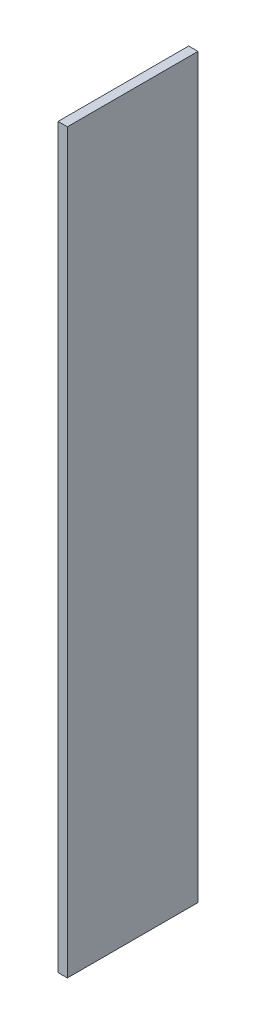
ISO-10303-21;
HEADER;
FILE_DESCRIPTION(('STEP AP214'),'2;1');
FILE_NAME('part.step','',(''),(''),'','','');
FILE_SCHEMA(('AUTOMOTIVE_DESIGN { 1 0 10303 214 1 1 1 1 }'));
ENDSEC;
DATA;
#1=APPLICATION_CONTEXT('core data for automotive mechanical design processes');
#2=APPLICATION_PROTOCOL_DEFINITION('international standard','automotive_design',2000,#1);
#3=PRODUCT_CONTEXT('',#1,'mechanical');
#4=PRODUCT('Part','Part','',(#3));
#5=PRODUCT_RELATED_PRODUCT_CATEGORY('part','',(#4));
#6=PRODUCT_DEFINITION_FORMATION('','',#4);
#7=PRODUCT_DEFINITION_CONTEXT('part definition',#1,'design');
#8=PRODUCT_DEFINITION('design','',#6,#7);
#9=PRODUCT_DEFINITION_SHAPE('','',#8);
#10=(LENGTH_UNIT() NAMED_UNIT(*) SI_UNIT(.MILLI.,.METRE.));
#11=(NAMED_UNIT(*) PLANE_ANGLE_UNIT() SI_UNIT($,.RADIAN.));
#12=(NAMED_UNIT(*) SI_UNIT($,.STERADIAN.) SOLID_ANGLE_UNIT());
#13=UNCERTAINTY_MEASURE_WITH_UNIT(LENGTH_MEASURE(1.E-05),#10,'distance_accuracy_value','');
#14=(GEOMETRIC_REPRESENTATION_CONTEXT(3) GLOBAL_UNCERTAINTY_ASSIGNED_CONTEXT((#13)) GLOBAL_UNIT_ASSIGNED_CONTEXT((#10,
#11,#12)) REPRESENTATION_CONTEXT('',''));
#15=CARTESIAN_POINT('',(0.,0.,0.));
#16=DIRECTION('',(0.,0.,1.));
#17=DIRECTION('',(1.,0.,0.));
#18=AXIS2_PLACEMENT_3D('',#15,#16,#17);
#19=CARTESIAN_POINT('',(6.35,0.,0.));
#20=DIRECTION('',(0.,0.,-1.));
#21=DIRECTION('',(-1.,0.,0.));
#22=AXIS2_PLACEMENT_3D('',#19,#20,#21);
#23=PLANE('',#22);
#24=DIRECTION('',(0.,-1.,0.));
#25=VECTOR('',#24,1.);
#26=CARTESIAN_POINT('',(0.,0.,0.));
#27=LINE('',#26,#25);
#28=CARTESIAN_POINT('',(0.,501.65,0.));
#29=VERTEX_POINT('',#28);
#30=CARTESIAN_POINT('',(0.,0.,0.));
#31=VERTEX_POINT('',#30);
#32=EDGE_CURVE('E96',#29,#31,#27,.T.);
#33=ORIENTED_EDGE('',*,*,#32,.T.);
#34=DIRECTION('',(-1.,0.,0.));
#35=VECTOR('',#34,1.);
#36=CARTESIAN_POINT('',(6.35,0.,0.));
#37=LINE('',#36,#35);
#38=CARTESIAN_POINT('',(6.35,0.,0.));
#39=VERTEX_POINT('',#38);
#40=EDGE_CURVE('E11',#39,#31,#37,.T.);
#41=ORIENTED_EDGE('',*,*,#40,.F.);
#42=DIRECTION('',(0.,-1.,0.));
#43=VECTOR('',#42,1.);
#44=CARTESIAN_POINT('',(6.35,0.,0.));
#45=LINE('',#44,#43);
#46=CARTESIAN_POINT('',(6.35,501.65,0.));
#47=VERTEX_POINT('',#46);
#48=EDGE_CURVE('E84',#47,#39,#45,.T.);
#49=ORIENTED_EDGE('',*,*,#48,.F.);
#50=DIRECTION('',(-1.,0.,0.));
#51=VECTOR('',#50,1.);
#52=CARTESIAN_POINT('',(6.35,501.65,0.));
#53=LINE('',#52,#51);
#54=EDGE_CURVE('E92',#47,#29,#53,.T.);
#55=ORIENTED_EDGE('',*,*,#54,.T.);
#56=EDGE_LOOP('',(#33,#41,#49,#55));
#57=FACE_BOUND('',#56,.T.);
#58=ADVANCED_FACE('F33',(#57),#23,.F.);
#59=CARTESIAN_POINT('',(6.35,0.,0.));
#60=DIRECTION('',(0.,1.,0.));
#61=DIRECTION('',(0.,0.,1.));
#62=AXIS2_PLACEMENT_3D('',#59,#60,#61);
#63=PLANE('',#62);
#64=DIRECTION('',(0.,0.,-1.));
#65=VECTOR('',#64,1.);
#66=CARTESIAN_POINT('',(0.,0.,0.));
#67=LINE('',#66,#65);
#68=CARTESIAN_POINT('',(0.,0.,-88.9));
#69=VERTEX_POINT('',#68);
#70=EDGE_CURVE('E88',#31,#69,#67,.T.);
#71=ORIENTED_EDGE('',*,*,#70,.T.);
#72=DIRECTION('',(-1.,0.,0.));
#73=VECTOR('',#72,1.);
#74=CARTESIAN_POINT('',(6.35,0.,-88.9));
#75=LINE('',#74,#73);
#76=CARTESIAN_POINT('',(6.35,0.,-88.9));
#77=VERTEX_POINT('',#76);
#78=EDGE_CURVE('E41',#77,#69,#75,.T.);
#79=ORIENTED_EDGE('',*,*,#78,.F.);
#80=DIRECTION('',(0.,0.,-1.));
#81=VECTOR('',#80,1.);
#82=CARTESIAN_POINT('',(6.35,0.,0.));
#83=LINE('',#82,#81);
#84=EDGE_CURVE('E79',#39,#77,#83,.T.);
#85=ORIENTED_EDGE('',*,*,#84,.F.);
#86=ORIENTED_EDGE('',*,*,#40,.T.);
#87=EDGE_LOOP('',(#71,#79,#85,#86));
#88=FACE_BOUND('',#87,.T.);
#89=ADVANCED_FACE('F87',(#88),#63,.F.);
#90=CARTESIAN_POINT('',(6.35,0.,-88.9));
#91=DIRECTION('',(0.,0.,1.));
#92=DIRECTION('',(1.,0.,0.));
#93=AXIS2_PLACEMENT_3D('',#90,#91,#92);
#94=PLANE('',#93);
#95=DIRECTION('',(0.,1.,0.));
#96=VECTOR('',#95,1.);
#97=CARTESIAN_POINT('',(0.,0.,-88.9));
#98=LINE('',#97,#96);
#99=CARTESIAN_POINT('',(0.,501.65,-88.9));
#100=VERTEX_POINT('',#99);
#101=EDGE_CURVE('E66',#69,#100,#98,.T.);
#102=ORIENTED_EDGE('',*,*,#101,.T.);
#103=DIRECTION('',(-1.,0.,0.));
#104=VECTOR('',#103,1.);
#105=CARTESIAN_POINT('',(6.35,501.65,-88.9));
#106=LINE('',#105,#104);
#107=CARTESIAN_POINT('',(6.35,501.65,-88.9));
#108=VERTEX_POINT('',#107);
#109=EDGE_CURVE('E89',#108,#100,#106,.T.);
#110=ORIENTED_EDGE('',*,*,#109,.F.);
#111=DIRECTION('',(0.,1.,0.));
#112=VECTOR('',#111,1.);
#113=CARTESIAN_POINT('',(6.35,0.,-88.9));
#114=LINE('',#113,#112);
#115=EDGE_CURVE('E82',#77,#108,#114,.T.);
#116=ORIENTED_EDGE('',*,*,#115,.F.);
#117=ORIENTED_EDGE('',*,*,#78,.T.);
#118=EDGE_LOOP('',(#102,#110,#116,#117));
#119=FACE_BOUND('',#118,.T.);
#120=ADVANCED_FACE('F90',(#119),#94,.F.);
#121=CARTESIAN_POINT('',(6.35,501.65,0.));
#122=DIRECTION('',(0.,-1.,0.));
#123=DIRECTION('',(0.,0.,-1.));
#124=AXIS2_PLACEMENT_3D('',#121,#122,#123);
#125=PLANE('',#124);
#126=DIRECTION('',(0.,0.,1.));
#127=VECTOR('',#126,1.);
#128=CARTESIAN_POINT('',(0.,501.65,0.));
#129=LINE('',#128,#127);
#130=EDGE_CURVE('E72',#100,#29,#129,.T.);
#131=ORIENTED_EDGE('',*,*,#130,.T.);
#132=ORIENTED_EDGE('',*,*,#54,.F.);
#133=DIRECTION('',(0.,0.,1.));
#134=VECTOR('',#133,1.);
#135=CARTESIAN_POINT('',(6.35,501.65,0.));
#136=LINE('',#135,#134);
#137=EDGE_CURVE('E49',#108,#47,#136,.T.);
#138=ORIENTED_EDGE('',*,*,#137,.F.);
#139=ORIENTED_EDGE('',*,*,#109,.T.);
#140=EDGE_LOOP('',(#131,#132,#138,#139));
#141=FACE_BOUND('',#140,.T.);
#142=ADVANCED_FACE('F103',(#141),#125,.F.);
#143=CARTESIAN_POINT('',(6.35,0.,0.));
#144=DIRECTION('',(-1.,0.,0.));
#145=DIRECTION('',(0.,0.,1.));
#146=AXIS2_PLACEMENT_3D('',#143,#144,#145);
#147=PLANE('',#146);
#148=ORIENTED_EDGE('',*,*,#48,.T.);
#149=ORIENTED_EDGE('',*,*,#84,.T.);
#150=ORIENTED_EDGE('',*,*,#115,.T.);
#151=ORIENTED_EDGE('',*,*,#137,.T.);
#152=EDGE_LOOP('',(#148,#149,#150,#151));
#153=FACE_BOUND('',#152,.T.);
#154=ADVANCED_FACE('F80',(#153),#147,.F.);
#155=CARTESIAN_POINT('',(0.,0.,0.));
#156=DIRECTION('',(-1.,0.,0.));
#157=DIRECTION('',(0.,0.,1.));
#158=AXIS2_PLACEMENT_3D('',#155,#156,#157);
#159=PLANE('',#158);
#160=ORIENTED_EDGE('',*,*,#32,.F.);
#161=ORIENTED_EDGE('',*,*,#130,.F.);
#162=ORIENTED_EDGE('',*,*,#101,.F.);
#163=ORIENTED_EDGE('',*,*,#70,.F.);
#164=EDGE_LOOP('',(#160,#161,#162,#163));
#165=FACE_BOUND('',#164,.T.);
#166=ADVANCED_FACE('F106',(#165),#159,.T.);
#167=CLOSED_SHELL('',(#58,#89,#120,#142,#154,#166));
#168=MANIFOLD_SOLID_BREP('B2',#167);
#169=ADVANCED_BREP_SHAPE_REPRESENTATION('',(#18,#168),#14);
#170=SHAPE_DEFINITION_REPRESENTATION(#9,#169);
ENDSEC;
END-ISO-10303-21;
